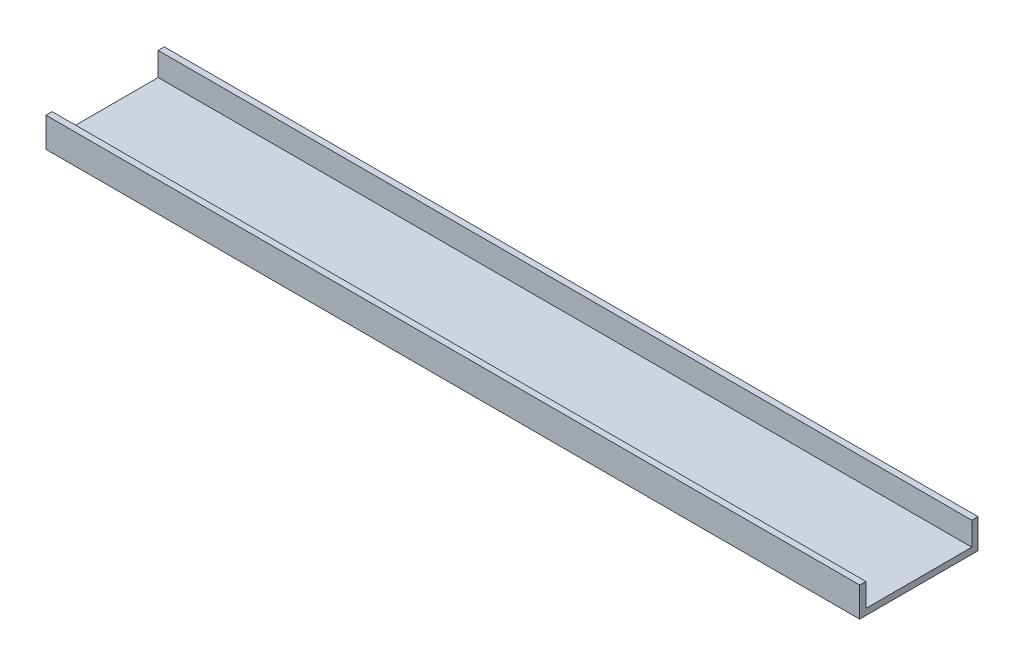
ISO-10303-21;
HEADER;
FILE_DESCRIPTION(('STEP AP214'),'2;1');
FILE_NAME('part.step','',(''),(''),'','','');
FILE_SCHEMA(('AUTOMOTIVE_DESIGN { 1 0 10303 214 1 1 1 1 }'));
ENDSEC;
DATA;
#1=APPLICATION_CONTEXT('core data for automotive mechanical design processes');
#2=APPLICATION_PROTOCOL_DEFINITION('international standard','automotive_design',2000,#1);
#3=PRODUCT_CONTEXT('',#1,'mechanical');
#4=PRODUCT('Part','Part','',(#3));
#5=PRODUCT_RELATED_PRODUCT_CATEGORY('part','',(#4));
#6=PRODUCT_DEFINITION_FORMATION('','',#4);
#7=PRODUCT_DEFINITION_CONTEXT('part definition',#1,'design');
#8=PRODUCT_DEFINITION('design','',#6,#7);
#9=PRODUCT_DEFINITION_SHAPE('','',#8);
#10=(LENGTH_UNIT() NAMED_UNIT(*) SI_UNIT(.MILLI.,.METRE.));
#11=(NAMED_UNIT(*) PLANE_ANGLE_UNIT() SI_UNIT($,.RADIAN.));
#12=(NAMED_UNIT(*) SI_UNIT($,.STERADIAN.) SOLID_ANGLE_UNIT());
#13=UNCERTAINTY_MEASURE_WITH_UNIT(LENGTH_MEASURE(1.E-05),#10,'distance_accuracy_value','');
#14=(GEOMETRIC_REPRESENTATION_CONTEXT(3) GLOBAL_UNCERTAINTY_ASSIGNED_CONTEXT((#13)) GLOBAL_UNIT_ASSIGNED_CONTEXT((#10,
#11,#12)) REPRESENTATION_CONTEXT('',''));
#15=CARTESIAN_POINT('',(0.,0.,0.));
#16=DIRECTION('',(0.,0.,1.));
#17=DIRECTION('',(1.,0.,0.));
#18=AXIS2_PLACEMENT_3D('',#15,#16,#17);
#19=CARTESIAN_POINT('',(0.,12.,0.));
#20=DIRECTION('',(0.,1.,0.));
#21=DIRECTION('',(0.,0.,1.));
#22=AXIS2_PLACEMENT_3D('',#19,#20,#21);
#23=PLANE('',#22);
#24=DIRECTION('',(1.,0.,0.));
#25=VECTOR('',#24,1.);
#26=CARTESIAN_POINT('',(-165.,12.,21.5));
#27=LINE('',#26,#25);
#28=CARTESIAN_POINT('',(-165.,12.,21.5));
#29=VERTEX_POINT('',#28);
#30=CARTESIAN_POINT('',(165.,12.,21.5));
#31=VERTEX_POINT('',#30);
#32=EDGE_CURVE('E130',#29,#31,#27,.T.);
#33=ORIENTED_EDGE('',*,*,#32,.F.);
#34=DIRECTION('',(0.,0.,1.));
#35=VECTOR('',#34,1.);
#36=CARTESIAN_POINT('',(-165.,12.,-24.));
#37=LINE('',#36,#35);
#38=CARTESIAN_POINT('',(-165.,12.,24.));
#39=VERTEX_POINT('',#38);
#40=EDGE_CURVE('E92',#29,#39,#37,.T.);
#41=ORIENTED_EDGE('',*,*,#40,.T.);
#42=DIRECTION('',(1.,0.,0.));
#43=VECTOR('',#42,1.);
#44=CARTESIAN_POINT('',(-165.,12.,24.));
#45=LINE('',#44,#43);
#46=CARTESIAN_POINT('',(165.,12.,24.));
#47=VERTEX_POINT('',#46);
#48=EDGE_CURVE('E152',#39,#47,#45,.T.);
#49=ORIENTED_EDGE('',*,*,#48,.T.);
#50=DIRECTION('',(0.,0.,-1.));
#51=VECTOR('',#50,1.);
#52=CARTESIAN_POINT('',(165.,12.,-24.));
#53=LINE('',#52,#51);
#54=EDGE_CURVE('E155',#47,#31,#53,.T.);
#55=ORIENTED_EDGE('',*,*,#54,.T.);
#56=EDGE_LOOP('',(#33,#41,#49,#55));
#57=FACE_BOUND('',#56,.T.);
#58=ADVANCED_FACE('F39',(#57),#23,.T.);
#59=CARTESIAN_POINT('',(-165.,12.,-24.));
#60=DIRECTION('',(1.,0.,0.));
#61=DIRECTION('',(0.,0.,-1.));
#62=AXIS2_PLACEMENT_3D('',#59,#60,#61);
#63=PLANE('',#62);
#64=ORIENTED_EDGE('',*,*,#40,.F.);
#65=DIRECTION('',(0.,-1.,0.));
#66=VECTOR('',#65,1.);
#67=CARTESIAN_POINT('',(-165.,12.,21.5));
#68=LINE('',#67,#66);
#69=CARTESIAN_POINT('',(-165.,2.5,21.5));
#70=VERTEX_POINT('',#69);
#71=EDGE_CURVE('E138',#29,#70,#68,.T.);
#72=ORIENTED_EDGE('',*,*,#71,.T.);
#73=DIRECTION('',(0.,0.,-1.));
#74=VECTOR('',#73,1.);
#75=CARTESIAN_POINT('',(-165.,2.5,21.5));
#76=LINE('',#75,#74);
#77=CARTESIAN_POINT('',(-165.,2.5,-21.5));
#78=VERTEX_POINT('',#77);
#79=EDGE_CURVE('E121',#70,#78,#76,.T.);
#80=ORIENTED_EDGE('',*,*,#79,.T.);
#81=DIRECTION('',(0.,1.,0.));
#82=VECTOR('',#81,1.);
#83=CARTESIAN_POINT('',(-165.,12.,-21.5));
#84=LINE('',#83,#82);
#85=CARTESIAN_POINT('',(-165.,12.,-21.5));
#86=VERTEX_POINT('',#85);
#87=EDGE_CURVE('E125',#78,#86,#84,.T.);
#88=ORIENTED_EDGE('',*,*,#87,.T.);
#89=CARTESIAN_POINT('',(-165.,12.,-24.));
#90=VERTEX_POINT('',#89);
#91=EDGE_CURVE('E150',#90,#86,#37,.T.);
#92=ORIENTED_EDGE('',*,*,#91,.F.);
#93=DIRECTION('',(0.,-1.,0.));
#94=VECTOR('',#93,1.);
#95=CARTESIAN_POINT('',(-165.,12.,-24.));
#96=LINE('',#95,#94);
#97=CARTESIAN_POINT('',(-165.,0.,-24.));
#98=VERTEX_POINT('',#97);
#99=EDGE_CURVE('E158',#90,#98,#96,.T.);
#100=ORIENTED_EDGE('',*,*,#99,.T.);
#101=DIRECTION('',(0.,0.,1.));
#102=VECTOR('',#101,1.);
#103=CARTESIAN_POINT('',(-165.,0.,-24.));
#104=LINE('',#103,#102);
#105=CARTESIAN_POINT('',(-165.,0.,24.));
#106=VERTEX_POINT('',#105);
#107=EDGE_CURVE('E146',#98,#106,#104,.T.);
#108=ORIENTED_EDGE('',*,*,#107,.T.);
#109=DIRECTION('',(0.,-1.,0.));
#110=VECTOR('',#109,1.);
#111=CARTESIAN_POINT('',(-165.,12.,24.));
#112=LINE('',#111,#110);
#113=EDGE_CURVE('E11',#39,#106,#112,.T.);
#114=ORIENTED_EDGE('',*,*,#113,.F.);
#115=EDGE_LOOP('',(#64,#72,#80,#88,#92,#100,#108,#114));
#116=FACE_BOUND('',#115,.T.);
#117=ADVANCED_FACE('F41',(#116),#63,.F.);
#118=CARTESIAN_POINT('',(-165.,12.,24.));
#119=DIRECTION('',(0.,0.,-1.));
#120=DIRECTION('',(-1.,0.,0.));
#121=AXIS2_PLACEMENT_3D('',#118,#119,#120);
#122=PLANE('',#121);
#123=DIRECTION('',(1.,0.,0.));
#124=VECTOR('',#123,1.);
#125=CARTESIAN_POINT('',(-165.,0.,24.));
#126=LINE('',#125,#124);
#127=CARTESIAN_POINT('',(165.,0.,24.));
#128=VERTEX_POINT('',#127);
#129=EDGE_CURVE('E161',#106,#128,#126,.T.);
#130=ORIENTED_EDGE('',*,*,#129,.T.);
#131=DIRECTION('',(0.,-1.,0.));
#132=VECTOR('',#131,1.);
#133=CARTESIAN_POINT('',(165.,12.,24.));
#134=LINE('',#133,#132);
#135=EDGE_CURVE('E47',#47,#128,#134,.T.);
#136=ORIENTED_EDGE('',*,*,#135,.F.);
#137=ORIENTED_EDGE('',*,*,#48,.F.);
#138=ORIENTED_EDGE('',*,*,#113,.T.);
#139=EDGE_LOOP('',(#130,#136,#137,#138));
#140=FACE_BOUND('',#139,.T.);
#141=ADVANCED_FACE('F183',(#140),#122,.F.);
#142=CARTESIAN_POINT('',(165.,12.,-24.));
#143=DIRECTION('',(-1.,0.,0.));
#144=DIRECTION('',(0.,0.,1.));
#145=AXIS2_PLACEMENT_3D('',#142,#143,#144);
#146=PLANE('',#145);
#147=DIRECTION('',(0.,0.,-1.));
#148=VECTOR('',#147,1.);
#149=CARTESIAN_POINT('',(165.,2.5,21.5));
#150=LINE('',#149,#148);
#151=CARTESIAN_POINT('',(165.,2.5,21.5));
#152=VERTEX_POINT('',#151);
#153=CARTESIAN_POINT('',(165.,2.5,-21.5));
#154=VERTEX_POINT('',#153);
#155=EDGE_CURVE('E119',#152,#154,#150,.T.);
#156=ORIENTED_EDGE('',*,*,#155,.F.);
#157=DIRECTION('',(0.,-1.,0.));
#158=VECTOR('',#157,1.);
#159=CARTESIAN_POINT('',(165.,12.,21.5));
#160=LINE('',#159,#158);
#161=EDGE_CURVE('E128',#31,#152,#160,.T.);
#162=ORIENTED_EDGE('',*,*,#161,.F.);
#163=ORIENTED_EDGE('',*,*,#54,.F.);
#164=ORIENTED_EDGE('',*,*,#135,.T.);
#165=DIRECTION('',(0.,0.,-1.));
#166=VECTOR('',#165,1.);
#167=CARTESIAN_POINT('',(165.,0.,-24.));
#168=LINE('',#167,#166);
#169=CARTESIAN_POINT('',(165.,0.,-24.));
#170=VERTEX_POINT('',#169);
#171=EDGE_CURVE('E163',#128,#170,#168,.T.);
#172=ORIENTED_EDGE('',*,*,#171,.T.);
#173=DIRECTION('',(0.,-1.,0.));
#174=VECTOR('',#173,1.);
#175=CARTESIAN_POINT('',(165.,12.,-24.));
#176=LINE('',#175,#174);
#177=CARTESIAN_POINT('',(165.,12.,-24.));
#178=VERTEX_POINT('',#177);
#179=EDGE_CURVE('E167',#178,#170,#176,.T.);
#180=ORIENTED_EDGE('',*,*,#179,.F.);
#181=CARTESIAN_POINT('',(165.,12.,-21.5));
#182=VERTEX_POINT('',#181);
#183=EDGE_CURVE('E154',#182,#178,#53,.T.);
#184=ORIENTED_EDGE('',*,*,#183,.F.);
#185=DIRECTION('',(0.,1.,0.));
#186=VECTOR('',#185,1.);
#187=CARTESIAN_POINT('',(165.,12.,-21.5));
#188=LINE('',#187,#186);
#189=EDGE_CURVE('E54',#154,#182,#188,.T.);
#190=ORIENTED_EDGE('',*,*,#189,.F.);
#191=EDGE_LOOP('',(#156,#162,#163,#164,#172,#180,#184,#190));
#192=FACE_BOUND('',#191,.T.);
#193=ADVANCED_FACE('F135',(#192),#146,.F.);
#194=CARTESIAN_POINT('',(-165.,12.,-24.));
#195=DIRECTION('',(0.,0.,1.));
#196=DIRECTION('',(1.,0.,0.));
#197=AXIS2_PLACEMENT_3D('',#194,#195,#196);
#198=PLANE('',#197);
#199=DIRECTION('',(-1.,0.,0.));
#200=VECTOR('',#199,1.);
#201=CARTESIAN_POINT('',(-165.,0.,-24.));
#202=LINE('',#201,#200);
#203=EDGE_CURVE('E84',#170,#98,#202,.T.);
#204=ORIENTED_EDGE('',*,*,#203,.T.);
#205=ORIENTED_EDGE('',*,*,#99,.F.);
#206=DIRECTION('',(-1.,0.,0.));
#207=VECTOR('',#206,1.);
#208=CARTESIAN_POINT('',(-165.,12.,-24.));
#209=LINE('',#208,#207);
#210=EDGE_CURVE('E63',#178,#90,#209,.T.);
#211=ORIENTED_EDGE('',*,*,#210,.F.);
#212=ORIENTED_EDGE('',*,*,#179,.T.);
#213=EDGE_LOOP('',(#204,#205,#211,#212));
#214=FACE_BOUND('',#213,.T.);
#215=ADVANCED_FACE('F179',(#214),#198,.F.);
#216=DIRECTION('',(1.,0.,0.));
#217=VECTOR('',#216,1.);
#218=CARTESIAN_POINT('',(-165.,12.,-21.5));
#219=LINE('',#218,#217);
#220=EDGE_CURVE('E147',#86,#182,#219,.T.);
#221=ORIENTED_EDGE('',*,*,#220,.T.);
#222=ORIENTED_EDGE('',*,*,#183,.T.);
#223=ORIENTED_EDGE('',*,*,#210,.T.);
#224=ORIENTED_EDGE('',*,*,#91,.T.);
#225=EDGE_LOOP('',(#221,#222,#223,#224));
#226=FACE_BOUND('',#225,.T.);
#227=ADVANCED_FACE('F180',(#226),#23,.T.);
#228=CARTESIAN_POINT('',(0.,0.,0.));
#229=DIRECTION('',(0.,1.,0.));
#230=DIRECTION('',(0.,0.,1.));
#231=AXIS2_PLACEMENT_3D('',#228,#229,#230);
#232=PLANE('',#231);
#233=ORIENTED_EDGE('',*,*,#107,.F.);
#234=ORIENTED_EDGE('',*,*,#203,.F.);
#235=ORIENTED_EDGE('',*,*,#171,.F.);
#236=ORIENTED_EDGE('',*,*,#129,.F.);
#237=EDGE_LOOP('',(#233,#234,#235,#236));
#238=FACE_BOUND('',#237,.T.);
#239=ADVANCED_FACE('F175',(#238),#232,.F.);
#240=CARTESIAN_POINT('',(-165.,12.,21.5));
#241=DIRECTION('',(0.,0.,1.));
#242=DIRECTION('',(1.,0.,0.));
#243=AXIS2_PLACEMENT_3D('',#240,#241,#242);
#244=PLANE('',#243);
#245=DIRECTION('',(1.,0.,0.));
#246=VECTOR('',#245,1.);
#247=CARTESIAN_POINT('',(-165.,2.5,21.5));
#248=LINE('',#247,#246);
#249=EDGE_CURVE('E115',#70,#152,#248,.T.);
#250=ORIENTED_EDGE('',*,*,#249,.F.);
#251=ORIENTED_EDGE('',*,*,#71,.F.);
#252=ORIENTED_EDGE('',*,*,#32,.T.);
#253=ORIENTED_EDGE('',*,*,#161,.T.);
#254=EDGE_LOOP('',(#250,#251,#252,#253));
#255=FACE_BOUND('',#254,.T.);
#256=ADVANCED_FACE('F129',(#255),#244,.F.);
#257=CARTESIAN_POINT('',(-165.,12.,-21.5));
#258=DIRECTION('',(0.,0.,-1.));
#259=DIRECTION('',(-1.,0.,0.));
#260=AXIS2_PLACEMENT_3D('',#257,#258,#259);
#261=PLANE('',#260);
#262=ORIENTED_EDGE('',*,*,#220,.F.);
#263=ORIENTED_EDGE('',*,*,#87,.F.);
#264=DIRECTION('',(1.,0.,0.));
#265=VECTOR('',#264,1.);
#266=CARTESIAN_POINT('',(-165.,2.5,-21.5));
#267=LINE('',#266,#265);
#268=EDGE_CURVE('E124',#78,#154,#267,.T.);
#269=ORIENTED_EDGE('',*,*,#268,.T.);
#270=ORIENTED_EDGE('',*,*,#189,.T.);
#271=EDGE_LOOP('',(#262,#263,#269,#270));
#272=FACE_BOUND('',#271,.T.);
#273=ADVANCED_FACE('F182',(#272),#261,.F.);
#274=CARTESIAN_POINT('',(-165.,2.5,21.5));
#275=DIRECTION('',(0.,-1.,0.));
#276=DIRECTION('',(0.,0.,-1.));
#277=AXIS2_PLACEMENT_3D('',#274,#275,#276);
#278=PLANE('',#277);
#279=ORIENTED_EDGE('',*,*,#268,.F.);
#280=ORIENTED_EDGE('',*,*,#79,.F.);
#281=ORIENTED_EDGE('',*,*,#249,.T.);
#282=ORIENTED_EDGE('',*,*,#155,.T.);
#283=EDGE_LOOP('',(#279,#280,#281,#282));
#284=FACE_BOUND('',#283,.T.);
#285=ADVANCED_FACE('F117',(#284),#278,.F.);
#286=CLOSED_SHELL('',(#58,#117,#141,#193,#215,#227,#239,#256,#273,#285));
#287=MANIFOLD_SOLID_BREP('B2',#286);
#288=ADVANCED_BREP_SHAPE_REPRESENTATION('',(#18,#287),#14);
#289=SHAPE_DEFINITION_REPRESENTATION(#9,#288);
ENDSEC;
END-ISO-10303-21;
